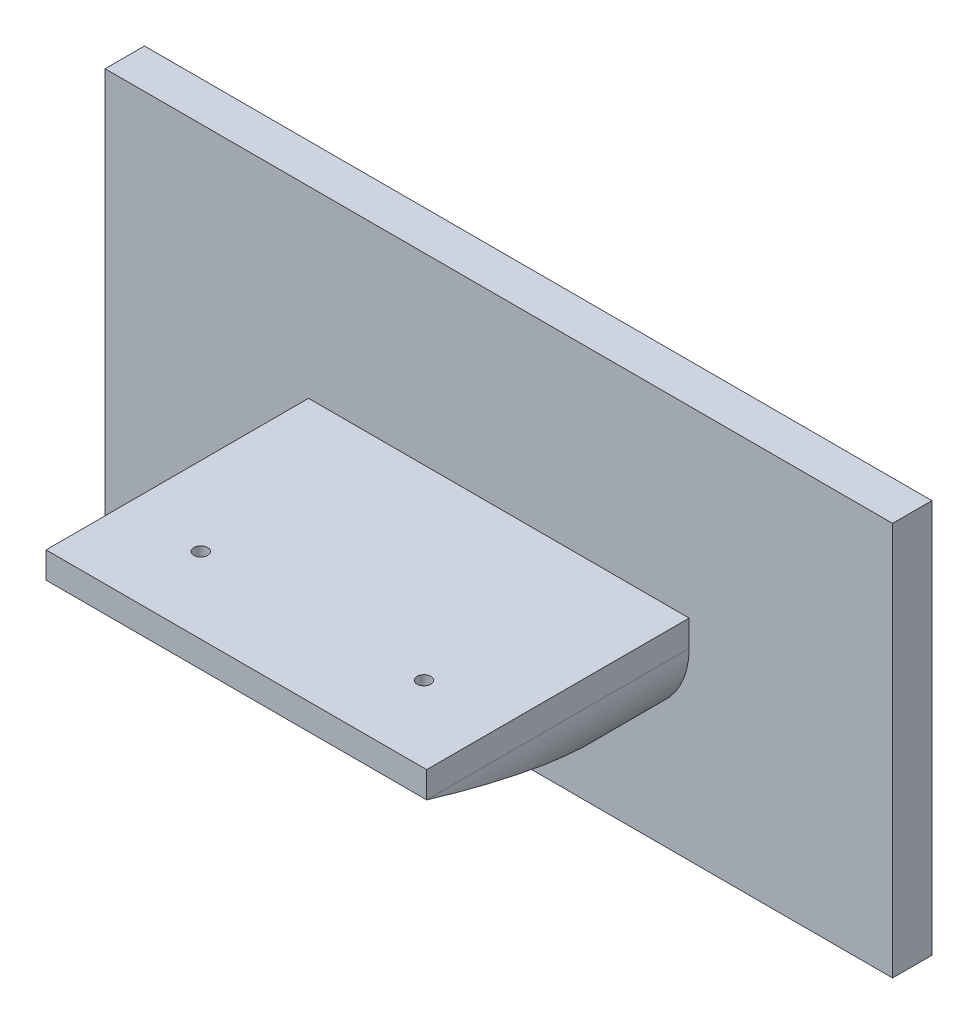
ISO-10303-21;
HEADER;
FILE_DESCRIPTION(('STEP AP214'),'2;1');
FILE_NAME('part.step','',(''),(''),'','','');
FILE_SCHEMA(('AUTOMOTIVE_DESIGN { 1 0 10303 214 1 1 1 1 }'));
ENDSEC;
DATA;
#1=APPLICATION_CONTEXT('core data for automotive mechanical design processes');
#2=APPLICATION_PROTOCOL_DEFINITION('international standard','automotive_design',2000,#1);
#3=PRODUCT_CONTEXT('',#1,'mechanical');
#4=PRODUCT('Part','Part','',(#3));
#5=PRODUCT_RELATED_PRODUCT_CATEGORY('part','',(#4));
#6=PRODUCT_DEFINITION_FORMATION('','',#4);
#7=PRODUCT_DEFINITION_CONTEXT('part definition',#1,'design');
#8=PRODUCT_DEFINITION('design','',#6,#7);
#9=PRODUCT_DEFINITION_SHAPE('','',#8);
#10=(LENGTH_UNIT() NAMED_UNIT(*) SI_UNIT(.MILLI.,.METRE.));
#11=(NAMED_UNIT(*) PLANE_ANGLE_UNIT() SI_UNIT($,.RADIAN.));
#12=(NAMED_UNIT(*) SI_UNIT($,.STERADIAN.) SOLID_ANGLE_UNIT());
#13=UNCERTAINTY_MEASURE_WITH_UNIT(LENGTH_MEASURE(1.E-05),#10,'distance_accuracy_value','');
#14=(GEOMETRIC_REPRESENTATION_CONTEXT(3) GLOBAL_UNCERTAINTY_ASSIGNED_CONTEXT((#13)) GLOBAL_UNIT_ASSIGNED_CONTEXT((#10,
#11,#12)) REPRESENTATION_CONTEXT('',''));
#15=CARTESIAN_POINT('',(0.,0.,0.));
#16=DIRECTION('',(0.,0.,1.));
#17=DIRECTION('',(1.,0.,0.));
#18=AXIS2_PLACEMENT_3D('',#15,#16,#17);
#19=CARTESIAN_POINT('',(107.5,70.,115.));
#20=DIRECTION('',(0.,0.,-1.));
#21=DIRECTION('',(-1.,0.,0.));
#22=AXIS2_PLACEMENT_3D('',#19,#20,#21);
#23=CYLINDRICAL_SURFACE('',#22,30.);
#24=CARTESIAN_POINT('',(107.5,70.,114.999999999999));
#25=DIRECTION('',(0.,-0.957826285221151,0.287347885566347));
#26=DIRECTION('',(0.,-0.287347885566347,-0.957826285221151));
#27=AXIS2_PLACEMENT_3D('',#24,#25,#26);
#28=ELLIPSE('',#27,104.403065089105,30.);
#29=CARTESIAN_POINT('',(77.5,70.0000000000002,115.));
#30=VERTEX_POINT('',#29);
#31=CARTESIAN_POINT('',(107.5,40.,15.));
#32=VERTEX_POINT('',#31);
#33=EDGE_CURVE('E107',#30,#32,#28,.T.);
#34=ORIENTED_EDGE('',*,*,#33,.F.);
#35=DIRECTION('',(0.,0.,-1.));
#36=VECTOR('',#35,1.);
#37=CARTESIAN_POINT('',(77.5,70.,115.));
#38=LINE('',#37,#36);
#39=CARTESIAN_POINT('',(77.5,70.,15.));
#40=VERTEX_POINT('',#39);
#41=EDGE_CURVE('E115',#30,#40,#38,.T.);
#42=ORIENTED_EDGE('',*,*,#41,.T.);
#43=CARTESIAN_POINT('',(107.5,70.,15.));
#44=DIRECTION('',(0.,0.,1.));
#45=DIRECTION('',(-1.,0.,0.));
#46=AXIS2_PLACEMENT_3D('',#43,#44,#45);
#47=CIRCLE('',#46,30.);
#48=EDGE_CURVE('E50',#40,#32,#47,.T.);
#49=ORIENTED_EDGE('',*,*,#48,.T.);
#50=EDGE_LOOP('',(#34,#42,#49));
#51=FACE_BOUND('',#50,.T.);
#52=ADVANCED_FACE('F33',(#51),#23,.T.);
#53=CARTESIAN_POINT('',(192.5,70.,115.));
#54=DIRECTION('',(0.,0.,-1.));
#55=DIRECTION('',(-1.,0.,0.));
#56=AXIS2_PLACEMENT_3D('',#53,#54,#55);
#57=CYLINDRICAL_SURFACE('',#56,30.);
#58=CARTESIAN_POINT('',(192.5,70.,114.999999999999));
#59=DIRECTION('',(0.,-0.957826285221151,0.287347885566347));
#60=DIRECTION('',(0.,-0.287347885566347,-0.957826285221151));
#61=AXIS2_PLACEMENT_3D('',#58,#59,#60);
#62=ELLIPSE('',#61,104.403065089105,30.);
#63=CARTESIAN_POINT('',(192.5,40.,15.));
#64=VERTEX_POINT('',#63);
#65=CARTESIAN_POINT('',(222.5,70.0000000000002,115.));
#66=VERTEX_POINT('',#65);
#67=EDGE_CURVE('E109',#64,#66,#62,.T.);
#68=ORIENTED_EDGE('',*,*,#67,.F.);
#69=CARTESIAN_POINT('',(192.5,70.,15.));
#70=DIRECTION('',(0.,0.,1.));
#71=DIRECTION('',(-1.,0.,0.));
#72=AXIS2_PLACEMENT_3D('',#69,#70,#71);
#73=CIRCLE('',#72,30.);
#74=CARTESIAN_POINT('',(222.5,70.0000000000002,15.));
#75=VERTEX_POINT('',#74);
#76=EDGE_CURVE('E186',#64,#75,#73,.T.);
#77=ORIENTED_EDGE('',*,*,#76,.T.);
#78=DIRECTION('',(0.,0.,-1.));
#79=VECTOR('',#78,1.);
#80=CARTESIAN_POINT('',(222.5,70.0000000000002,115.));
#81=LINE('',#80,#79);
#82=EDGE_CURVE('E132',#66,#75,#81,.T.);
#83=ORIENTED_EDGE('',*,*,#82,.F.);
#84=EDGE_LOOP('',(#68,#77,#83));
#85=FACE_BOUND('',#84,.T.);
#86=ADVANCED_FACE('F199',(#85),#57,.T.);
#87=CARTESIAN_POINT('',(107.5,70.,115.));
#88=DIRECTION('',(0.,0.,-1.));
#89=DIRECTION('',(-1.,0.,0.));
#90=AXIS2_PLACEMENT_3D('',#87,#88,#89);
#91=PLANE('',#90);
#92=DIRECTION('',(-1.,0.,0.));
#93=VECTOR('',#92,1.);
#94=CARTESIAN_POINT('',(107.5,70.0000000000002,115.));
#95=LINE('',#94,#93);
#96=EDGE_CURVE('E11',#66,#30,#95,.T.);
#97=ORIENTED_EDGE('',*,*,#96,.F.);
#98=DIRECTION('',(0.,1.,0.));
#99=VECTOR('',#98,1.);
#100=CARTESIAN_POINT('',(222.5,80.,115.));
#101=LINE('',#100,#99);
#102=CARTESIAN_POINT('',(222.5,80.,115.));
#103=VERTEX_POINT('',#102);
#104=EDGE_CURVE('E127',#66,#103,#101,.T.);
#105=ORIENTED_EDGE('',*,*,#104,.T.);
#106=DIRECTION('',(-1.,0.,0.));
#107=VECTOR('',#106,1.);
#108=CARTESIAN_POINT('',(77.5,80.,115.));
#109=LINE('',#108,#107);
#110=CARTESIAN_POINT('',(77.5,80.,115.));
#111=VERTEX_POINT('',#110);
#112=EDGE_CURVE('E123',#103,#111,#109,.T.);
#113=ORIENTED_EDGE('',*,*,#112,.T.);
#114=DIRECTION('',(0.,-1.,0.));
#115=VECTOR('',#114,1.);
#116=CARTESIAN_POINT('',(77.5,80.,115.));
#117=LINE('',#116,#115);
#118=EDGE_CURVE('E120',#111,#30,#117,.T.);
#119=ORIENTED_EDGE('',*,*,#118,.T.);
#120=EDGE_LOOP('',(#97,#105,#113,#119));
#121=FACE_BOUND('',#120,.T.);
#122=ADVANCED_FACE('F121',(#121),#91,.F.);
#123=CARTESIAN_POINT('',(0.,0.,15.));
#124=DIRECTION('',(0.,0.,-1.));
#125=DIRECTION('',(-1.,0.,0.));
#126=AXIS2_PLACEMENT_3D('',#123,#124,#125);
#127=PLANE('',#126);
#128=ORIENTED_EDGE('',*,*,#76,.F.);
#129=DIRECTION('',(1.,0.,0.));
#130=VECTOR('',#129,1.);
#131=CARTESIAN_POINT('',(107.5,40.,15.));
#132=LINE('',#131,#130);
#133=EDGE_CURVE('E184',#32,#64,#132,.T.);
#134=ORIENTED_EDGE('',*,*,#133,.F.);
#135=ORIENTED_EDGE('',*,*,#48,.F.);
#136=DIRECTION('',(0.,-1.,0.));
#137=VECTOR('',#136,1.);
#138=CARTESIAN_POINT('',(77.5,80.,15.));
#139=LINE('',#138,#137);
#140=CARTESIAN_POINT('',(77.5,80.,15.));
#141=VERTEX_POINT('',#140);
#142=EDGE_CURVE('E117',#141,#40,#139,.T.);
#143=ORIENTED_EDGE('',*,*,#142,.F.);
#144=DIRECTION('',(-1.,0.,0.));
#145=VECTOR('',#144,1.);
#146=CARTESIAN_POINT('',(77.5,80.,15.));
#147=LINE('',#146,#145);
#148=CARTESIAN_POINT('',(222.5,80.,15.));
#149=VERTEX_POINT('',#148);
#150=EDGE_CURVE('E128',#149,#141,#147,.T.);
#151=ORIENTED_EDGE('',*,*,#150,.F.);
#152=DIRECTION('',(0.,1.,0.));
#153=VECTOR('',#152,1.);
#154=CARTESIAN_POINT('',(222.5,80.,15.));
#155=LINE('',#154,#153);
#156=EDGE_CURVE('E57',#75,#149,#155,.T.);
#157=ORIENTED_EDGE('',*,*,#156,.F.);
#158=EDGE_LOOP('',(#128,#134,#135,#143,#151,#157));
#159=FACE_BOUND('',#158,.T.);
#160=DIRECTION('',(0.,1.,0.));
#161=VECTOR('',#160,1.);
#162=CARTESIAN_POINT('',(300.,0.,15.));
#163=LINE('',#162,#161);
#164=CARTESIAN_POINT('',(300.,0.,15.));
#165=VERTEX_POINT('',#164);
#166=CARTESIAN_POINT('',(300.,150.,15.));
#167=VERTEX_POINT('',#166);
#168=EDGE_CURVE('E147',#165,#167,#163,.T.);
#169=ORIENTED_EDGE('',*,*,#168,.T.);
#170=DIRECTION('',(-1.,0.,0.));
#171=VECTOR('',#170,1.);
#172=CARTESIAN_POINT('',(0.,150.,15.));
#173=LINE('',#172,#171);
#174=CARTESIAN_POINT('',(0.,150.,15.));
#175=VERTEX_POINT('',#174);
#176=EDGE_CURVE('E149',#167,#175,#173,.T.);
#177=ORIENTED_EDGE('',*,*,#176,.T.);
#178=DIRECTION('',(0.,-1.,0.));
#179=VECTOR('',#178,1.);
#180=CARTESIAN_POINT('',(0.,0.,15.));
#181=LINE('',#180,#179);
#182=CARTESIAN_POINT('',(0.,0.,15.));
#183=VERTEX_POINT('',#182);
#184=EDGE_CURVE('E142',#175,#183,#181,.T.);
#185=ORIENTED_EDGE('',*,*,#184,.T.);
#186=DIRECTION('',(1.,0.,0.));
#187=VECTOR('',#186,1.);
#188=CARTESIAN_POINT('',(0.,0.,15.));
#189=LINE('',#188,#187);
#190=EDGE_CURVE('E144',#183,#165,#189,.T.);
#191=ORIENTED_EDGE('',*,*,#190,.T.);
#192=EDGE_LOOP('',(#169,#177,#185,#191));
#193=FACE_BOUND('',#192,.T.);
#194=ADVANCED_FACE('F200',(#159,#193),#127,.F.);
#195=CARTESIAN_POINT('',(0.,0.,15.));
#196=DIRECTION('',(1.,0.,0.));
#197=DIRECTION('',(0.,0.,-1.));
#198=AXIS2_PLACEMENT_3D('',#195,#196,#197);
#199=PLANE('',#198);
#200=DIRECTION('',(0.,-1.,0.));
#201=VECTOR('',#200,1.);
#202=CARTESIAN_POINT('',(0.,0.,0.));
#203=LINE('',#202,#201);
#204=CARTESIAN_POINT('',(0.,150.,0.));
#205=VERTEX_POINT('',#204);
#206=CARTESIAN_POINT('',(0.,0.,0.));
#207=VERTEX_POINT('',#206);
#208=EDGE_CURVE('E131',#205,#207,#203,.T.);
#209=ORIENTED_EDGE('',*,*,#208,.T.);
#210=DIRECTION('',(0.,0.,-1.));
#211=VECTOR('',#210,1.);
#212=CARTESIAN_POINT('',(0.,0.,15.));
#213=LINE('',#212,#211);
#214=EDGE_CURVE('E42',#183,#207,#213,.T.);
#215=ORIENTED_EDGE('',*,*,#214,.F.);
#216=ORIENTED_EDGE('',*,*,#184,.F.);
#217=DIRECTION('',(0.,0.,-1.));
#218=VECTOR('',#217,1.);
#219=CARTESIAN_POINT('',(0.,150.,15.));
#220=LINE('',#219,#218);
#221=EDGE_CURVE('E150',#175,#205,#220,.T.);
#222=ORIENTED_EDGE('',*,*,#221,.T.);
#223=EDGE_LOOP('',(#209,#215,#216,#222));
#224=FACE_BOUND('',#223,.T.);
#225=ADVANCED_FACE('F35',(#224),#199,.F.);
#226=CARTESIAN_POINT('',(0.,0.,15.));
#227=DIRECTION('',(0.,1.,0.));
#228=DIRECTION('',(0.,0.,1.));
#229=AXIS2_PLACEMENT_3D('',#226,#227,#228);
#230=PLANE('',#229);
#231=DIRECTION('',(1.,0.,0.));
#232=VECTOR('',#231,1.);
#233=CARTESIAN_POINT('',(0.,0.,0.));
#234=LINE('',#233,#232);
#235=CARTESIAN_POINT('',(300.,0.,0.));
#236=VERTEX_POINT('',#235);
#237=EDGE_CURVE('E135',#207,#236,#234,.T.);
#238=ORIENTED_EDGE('',*,*,#237,.T.);
#239=DIRECTION('',(0.,0.,-1.));
#240=VECTOR('',#239,1.);
#241=CARTESIAN_POINT('',(300.,0.,15.));
#242=LINE('',#241,#240);
#243=EDGE_CURVE('E161',#165,#236,#242,.T.);
#244=ORIENTED_EDGE('',*,*,#243,.F.);
#245=ORIENTED_EDGE('',*,*,#190,.F.);
#246=ORIENTED_EDGE('',*,*,#214,.T.);
#247=EDGE_LOOP('',(#238,#244,#245,#246));
#248=FACE_BOUND('',#247,.T.);
#249=ADVANCED_FACE('F221',(#248),#230,.F.);
#250=CARTESIAN_POINT('',(300.,0.,15.));
#251=DIRECTION('',(-1.,0.,0.));
#252=DIRECTION('',(0.,0.,1.));
#253=AXIS2_PLACEMENT_3D('',#250,#251,#252);
#254=PLANE('',#253);
#255=DIRECTION('',(0.,1.,0.));
#256=VECTOR('',#255,1.);
#257=CARTESIAN_POINT('',(300.,0.,0.));
#258=LINE('',#257,#256);
#259=CARTESIAN_POINT('',(300.,150.,0.));
#260=VERTEX_POINT('',#259);
#261=EDGE_CURVE('E153',#236,#260,#258,.T.);
#262=ORIENTED_EDGE('',*,*,#261,.T.);
#263=DIRECTION('',(0.,0.,-1.));
#264=VECTOR('',#263,1.);
#265=CARTESIAN_POINT('',(300.,150.,15.));
#266=LINE('',#265,#264);
#267=EDGE_CURVE('E158',#167,#260,#266,.T.);
#268=ORIENTED_EDGE('',*,*,#267,.F.);
#269=ORIENTED_EDGE('',*,*,#168,.F.);
#270=ORIENTED_EDGE('',*,*,#243,.T.);
#271=EDGE_LOOP('',(#262,#268,#269,#270));
#272=FACE_BOUND('',#271,.T.);
#273=ADVANCED_FACE('F211',(#272),#254,.F.);
#274=CARTESIAN_POINT('',(0.,150.,15.));
#275=DIRECTION('',(0.,-1.,0.));
#276=DIRECTION('',(0.,0.,-1.));
#277=AXIS2_PLACEMENT_3D('',#274,#275,#276);
#278=PLANE('',#277);
#279=DIRECTION('',(-1.,0.,0.));
#280=VECTOR('',#279,1.);
#281=CARTESIAN_POINT('',(0.,150.,0.));
#282=LINE('',#281,#280);
#283=EDGE_CURVE('E145',#260,#205,#282,.T.);
#284=ORIENTED_EDGE('',*,*,#283,.T.);
#285=ORIENTED_EDGE('',*,*,#221,.F.);
#286=ORIENTED_EDGE('',*,*,#176,.F.);
#287=ORIENTED_EDGE('',*,*,#267,.T.);
#288=EDGE_LOOP('',(#284,#285,#286,#287));
#289=FACE_BOUND('',#288,.T.);
#290=ADVANCED_FACE('F215',(#289),#278,.F.);
#291=CARTESIAN_POINT('',(0.,0.,0.));
#292=DIRECTION('',(0.,0.,-1.));
#293=DIRECTION('',(-1.,0.,0.));
#294=AXIS2_PLACEMENT_3D('',#291,#292,#293);
#295=PLANE('',#294);
#296=ORIENTED_EDGE('',*,*,#208,.F.);
#297=ORIENTED_EDGE('',*,*,#283,.F.);
#298=ORIENTED_EDGE('',*,*,#261,.F.);
#299=ORIENTED_EDGE('',*,*,#237,.F.);
#300=EDGE_LOOP('',(#296,#297,#298,#299));
#301=FACE_BOUND('',#300,.T.);
#302=ADVANCED_FACE('F223',(#301),#295,.T.);
#303=CARTESIAN_POINT('',(77.5,80.,115.));
#304=DIRECTION('',(1.,0.,0.));
#305=DIRECTION('',(0.,0.,-1.));
#306=AXIS2_PLACEMENT_3D('',#303,#304,#305);
#307=PLANE('',#306);
#308=ORIENTED_EDGE('',*,*,#142,.T.);
#309=ORIENTED_EDGE('',*,*,#41,.F.);
#310=ORIENTED_EDGE('',*,*,#118,.F.);
#311=DIRECTION('',(0.,0.,-1.));
#312=VECTOR('',#311,1.);
#313=CARTESIAN_POINT('',(77.5,80.,115.));
#314=LINE('',#313,#312);
#315=EDGE_CURVE('E181',#111,#141,#314,.T.);
#316=ORIENTED_EDGE('',*,*,#315,.T.);
#317=EDGE_LOOP('',(#308,#309,#310,#316));
#318=FACE_BOUND('',#317,.T.);
#319=ADVANCED_FACE('F130',(#318),#307,.F.);
#320=CARTESIAN_POINT('',(222.5,80.,115.));
#321=DIRECTION('',(-1.,0.,0.));
#322=DIRECTION('',(0.,0.,1.));
#323=AXIS2_PLACEMENT_3D('',#320,#321,#322);
#324=PLANE('',#323);
#325=ORIENTED_EDGE('',*,*,#156,.T.);
#326=DIRECTION('',(0.,0.,-1.));
#327=VECTOR('',#326,1.);
#328=CARTESIAN_POINT('',(222.5,80.,115.));
#329=LINE('',#328,#327);
#330=EDGE_CURVE('E138',#103,#149,#329,.T.);
#331=ORIENTED_EDGE('',*,*,#330,.F.);
#332=ORIENTED_EDGE('',*,*,#104,.F.);
#333=ORIENTED_EDGE('',*,*,#82,.T.);
#334=EDGE_LOOP('',(#325,#331,#332,#333));
#335=FACE_BOUND('',#334,.T.);
#336=ADVANCED_FACE('F197',(#335),#324,.F.);
#337=CARTESIAN_POINT('',(77.5,80.,115.));
#338=DIRECTION('',(0.,-1.,0.));
#339=DIRECTION('',(1.,0.,0.));
#340=AXIS2_PLACEMENT_3D('',#337,#338,#339);
#341=PLANE('',#340);
#342=CARTESIAN_POINT('',(107.5,80.,86.0413016473366));
#343=DIRECTION('',(0.,1.,0.));
#344=DIRECTION('',(0.,0.,1.));
#345=AXIS2_PLACEMENT_3D('',#342,#343,#344);
#346=CIRCLE('',#345,2.60985);
#347=CARTESIAN_POINT('',(107.5,80.,88.6511516473366));
#348=VERTEX_POINT('',#347);
#349=EDGE_CURVE('E176',#348,#348,#346,.T.);
#350=ORIENTED_EDGE('',*,*,#349,.F.);
#351=EDGE_LOOP('',(#350));
#352=FACE_BOUND('',#351,.T.);
#353=CARTESIAN_POINT('',(192.5,80.,86.0413016473366));
#354=DIRECTION('',(0.,1.,0.));
#355=DIRECTION('',(0.,0.,1.));
#356=AXIS2_PLACEMENT_3D('',#353,#354,#355);
#357=CIRCLE('',#356,2.60985);
#358=CARTESIAN_POINT('',(192.5,80.,88.6511516473366));
#359=VERTEX_POINT('',#358);
#360=EDGE_CURVE('E167',#359,#359,#357,.T.);
#361=ORIENTED_EDGE('',*,*,#360,.F.);
#362=EDGE_LOOP('',(#361));
#363=FACE_BOUND('',#362,.T.);
#364=ORIENTED_EDGE('',*,*,#150,.T.);
#365=ORIENTED_EDGE('',*,*,#315,.F.);
#366=ORIENTED_EDGE('',*,*,#112,.F.);
#367=ORIENTED_EDGE('',*,*,#330,.T.);
#368=EDGE_LOOP('',(#364,#365,#366,#367));
#369=FACE_BOUND('',#368,.T.);
#370=ADVANCED_FACE('F194',(#352,#363,#369),#341,.F.);
#371=CARTESIAN_POINT('',(300.,70.0000000000002,115.));
#372=DIRECTION('',(0.,-0.957826285221151,0.287347885566347));
#373=DIRECTION('',(0.,-0.287347885566347,-0.957826285221151));
#374=AXIS2_PLACEMENT_3D('',#371,#372,#373);
#375=PLANE('',#374);
#376=CARTESIAN_POINT('',(107.5,61.3123904942011,86.0413016473366));
#377=DIRECTION('',(0.,-0.957826285221151,0.287347885566347));
#378=DIRECTION('',(0.,0.287347885566347,0.957826285221151));
#379=AXIS2_PLACEMENT_3D('',#376,#377,#378);
#380=ELLIPSE('',#379,2.72476339422802,2.60985);
#381=CARTESIAN_POINT('',(107.5,62.0953454942011,88.6511516473366));
#382=VERTEX_POINT('',#381);
#383=EDGE_CURVE('E37',#382,#382,#380,.T.);
#384=ORIENTED_EDGE('',*,*,#383,.F.);
#385=EDGE_LOOP('',(#384));
#386=FACE_BOUND('',#385,.T.);
#387=CARTESIAN_POINT('',(192.5,61.3123904942011,86.0413016473366));
#388=DIRECTION('',(0.,-0.957826285221151,0.287347885566347));
#389=DIRECTION('',(0.,0.287347885566347,0.957826285221151));
#390=AXIS2_PLACEMENT_3D('',#387,#388,#389);
#391=ELLIPSE('',#390,2.72476339422802,2.60985);
#392=CARTESIAN_POINT('',(192.5,62.0953454942011,88.6511516473366));
#393=VERTEX_POINT('',#392);
#394=EDGE_CURVE('E165',#393,#393,#391,.T.);
#395=ORIENTED_EDGE('',*,*,#394,.F.);
#396=EDGE_LOOP('',(#395));
#397=FACE_BOUND('',#396,.T.);
#398=ORIENTED_EDGE('',*,*,#33,.T.);
#399=ORIENTED_EDGE('',*,*,#133,.T.);
#400=ORIENTED_EDGE('',*,*,#67,.T.);
#401=ORIENTED_EDGE('',*,*,#96,.T.);
#402=EDGE_LOOP('',(#398,#399,#400,#401));
#403=FACE_BOUND('',#402,.T.);
#404=ADVANCED_FACE('F106',(#386,#397,#403),#375,.T.);
#405=CARTESIAN_POINT('',(192.5,80.,86.0413016473366));
#406=DIRECTION('',(0.,1.,0.));
#407=DIRECTION('',(0.,0.,1.));
#408=AXIS2_PLACEMENT_3D('',#405,#406,#407);
#409=CYLINDRICAL_SURFACE('',#408,2.60985);
#410=ORIENTED_EDGE('',*,*,#394,.T.);
#411=EDGE_LOOP('',(#410));
#412=FACE_BOUND('',#411,.T.);
#413=ORIENTED_EDGE('',*,*,#360,.T.);
#414=EDGE_LOOP('',(#413));
#415=FACE_BOUND('',#414,.T.);
#416=ADVANCED_FACE('F248',(#412,#415),#409,.F.);
#417=CARTESIAN_POINT('',(107.5,80.,86.0413016473366));
#418=DIRECTION('',(0.,1.,0.));
#419=DIRECTION('',(0.,0.,1.));
#420=AXIS2_PLACEMENT_3D('',#417,#418,#419);
#421=CYLINDRICAL_SURFACE('',#420,2.60985);
#422=ORIENTED_EDGE('',*,*,#383,.T.);
#423=EDGE_LOOP('',(#422));
#424=FACE_BOUND('',#423,.T.);
#425=ORIENTED_EDGE('',*,*,#349,.T.);
#426=EDGE_LOOP('',(#425));
#427=FACE_BOUND('',#426,.T.);
#428=ADVANCED_FACE('F252',(#424,#427),#421,.F.);
#429=CLOSED_SHELL('',(#52,#86,#122,#194,#225,#249,#273,#290,#302,#319,#336,#370,#404,#416,#428));
#430=MANIFOLD_SOLID_BREP('B2',#429);
#431=ADVANCED_BREP_SHAPE_REPRESENTATION('',(#18,#430),#14);
#432=SHAPE_DEFINITION_REPRESENTATION(#9,#431);
ENDSEC;
END-ISO-10303-21;
